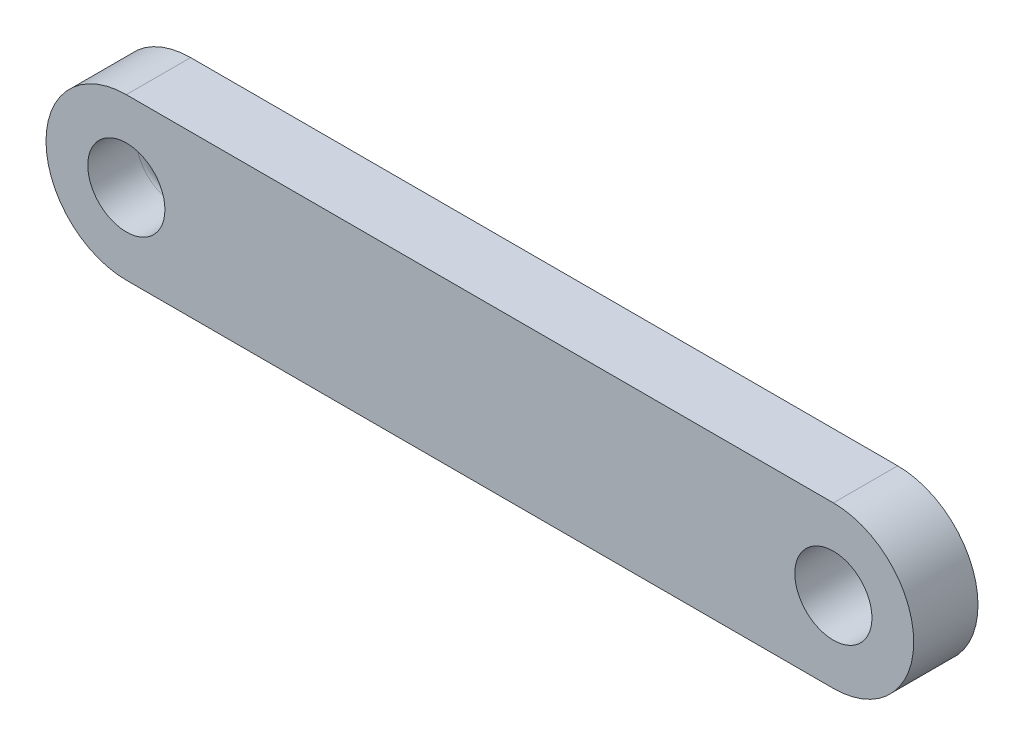
ISO-10303-21;
HEADER;
FILE_DESCRIPTION(('STEP AP214'),'2;1');
FILE_NAME('part.step','',(''),(''),'','','');
FILE_SCHEMA(('AUTOMOTIVE_DESIGN { 1 0 10303 214 1 1 1 1 }'));
ENDSEC;
DATA;
#1=APPLICATION_CONTEXT('core data for automotive mechanical design processes');
#2=APPLICATION_PROTOCOL_DEFINITION('international standard','automotive_design',2000,#1);
#3=PRODUCT_CONTEXT('',#1,'mechanical');
#4=PRODUCT('Part','Part','',(#3));
#5=PRODUCT_RELATED_PRODUCT_CATEGORY('part','',(#4));
#6=PRODUCT_DEFINITION_FORMATION('','',#4);
#7=PRODUCT_DEFINITION_CONTEXT('part definition',#1,'design');
#8=PRODUCT_DEFINITION('design','',#6,#7);
#9=PRODUCT_DEFINITION_SHAPE('','',#8);
#10=(LENGTH_UNIT() NAMED_UNIT(*) SI_UNIT(.MILLI.,.METRE.));
#11=(NAMED_UNIT(*) PLANE_ANGLE_UNIT() SI_UNIT($,.RADIAN.));
#12=(NAMED_UNIT(*) SI_UNIT($,.STERADIAN.) SOLID_ANGLE_UNIT());
#13=UNCERTAINTY_MEASURE_WITH_UNIT(LENGTH_MEASURE(1.E-05),#10,'distance_accuracy_value','');
#14=(GEOMETRIC_REPRESENTATION_CONTEXT(3) GLOBAL_UNCERTAINTY_ASSIGNED_CONTEXT((#13)) GLOBAL_UNIT_ASSIGNED_CONTEXT((#10,
#11,#12)) REPRESENTATION_CONTEXT('',''));
#15=CARTESIAN_POINT('',(0.,0.,0.));
#16=DIRECTION('',(0.,0.,1.));
#17=DIRECTION('',(1.,0.,0.));
#18=AXIS2_PLACEMENT_3D('',#15,#16,#17);
#19=CARTESIAN_POINT('',(0.,0.,20.));
#20=DIRECTION('',(0.,0.,1.));
#21=DIRECTION('',(1.,0.,0.));
#22=AXIS2_PLACEMENT_3D('',#19,#20,#21);
#23=PLANE('',#22);
#24=CARTESIAN_POINT('',(220.,0.,20.));
#25=DIRECTION('',(0.,0.,1.));
#26=DIRECTION('',(1.,0.,0.));
#27=AXIS2_PLACEMENT_3D('',#24,#25,#26);
#28=CIRCLE('',#27,12.);
#29=CARTESIAN_POINT('',(232.,0.,20.));
#30=VERTEX_POINT('',#29);
#31=EDGE_CURVE('E104',#30,#30,#28,.T.);
#32=ORIENTED_EDGE('',*,*,#31,.F.);
#33=EDGE_LOOP('',(#32));
#34=FACE_BOUND('',#33,.T.);
#35=CARTESIAN_POINT('',(0.,0.,20.));
#36=DIRECTION('',(0.,0.,1.));
#37=DIRECTION('',(1.,0.,0.));
#38=AXIS2_PLACEMENT_3D('',#35,#36,#37);
#39=CIRCLE('',#38,25.);
#40=CARTESIAN_POINT('',(0.,25.,20.));
#41=VERTEX_POINT('',#40);
#42=CARTESIAN_POINT('',(0.,-25.,20.));
#43=VERTEX_POINT('',#42);
#44=EDGE_CURVE('E86',#41,#43,#39,.T.);
#45=ORIENTED_EDGE('',*,*,#44,.T.);
#46=DIRECTION('',(1.,0.,0.));
#47=VECTOR('',#46,1.);
#48=CARTESIAN_POINT('',(0.,-25.,20.));
#49=LINE('',#48,#47);
#50=CARTESIAN_POINT('',(220.,-25.,20.));
#51=VERTEX_POINT('',#50);
#52=EDGE_CURVE('E81',#43,#51,#49,.T.);
#53=ORIENTED_EDGE('',*,*,#52,.T.);
#54=CARTESIAN_POINT('',(220.,0.,20.));
#55=DIRECTION('',(0.,0.,1.));
#56=DIRECTION('',(1.,0.,0.));
#57=AXIS2_PLACEMENT_3D('',#54,#55,#56);
#58=CIRCLE('',#57,25.);
#59=CARTESIAN_POINT('',(220.,25.,20.));
#60=VERTEX_POINT('',#59);
#61=EDGE_CURVE('E84',#51,#60,#58,.T.);
#62=ORIENTED_EDGE('',*,*,#61,.T.);
#63=DIRECTION('',(-1.,0.,0.));
#64=VECTOR('',#63,1.);
#65=CARTESIAN_POINT('',(0.,25.,20.));
#66=LINE('',#65,#64);
#67=EDGE_CURVE('E50',#60,#41,#66,.T.);
#68=ORIENTED_EDGE('',*,*,#67,.T.);
#69=EDGE_LOOP('',(#45,#53,#62,#68));
#70=FACE_BOUND('',#69,.T.);
#71=CARTESIAN_POINT('',(0.,0.,20.));
#72=DIRECTION('',(0.,0.,1.));
#73=DIRECTION('',(1.,0.,0.));
#74=AXIS2_PLACEMENT_3D('',#71,#72,#73);
#75=CIRCLE('',#74,12.);
#76=CARTESIAN_POINT('',(12.,0.,20.));
#77=VERTEX_POINT('',#76);
#78=EDGE_CURVE('E155',#77,#77,#75,.T.);
#79=ORIENTED_EDGE('',*,*,#78,.F.);
#80=EDGE_LOOP('',(#79));
#81=FACE_BOUND('',#80,.T.);
#82=ADVANCED_FACE('F33',(#34,#70,#81),#23,.T.);
#83=CARTESIAN_POINT('',(0.,0.,0.));
#84=DIRECTION('',(0.,0.,1.));
#85=DIRECTION('',(1.,0.,0.));
#86=AXIS2_PLACEMENT_3D('',#83,#84,#85);
#87=PLANE('',#86);
#88=CARTESIAN_POINT('',(0.,0.,0.));
#89=DIRECTION('',(0.,0.,1.));
#90=DIRECTION('',(1.,0.,0.));
#91=AXIS2_PLACEMENT_3D('',#88,#89,#90);
#92=CIRCLE('',#91,17.);
#93=CARTESIAN_POINT('',(17.,0.,0.));
#94=VERTEX_POINT('',#93);
#95=EDGE_CURVE('E42',#94,#94,#92,.T.);
#96=ORIENTED_EDGE('',*,*,#95,.T.);
#97=EDGE_LOOP('',(#96));
#98=FACE_BOUND('',#97,.T.);
#99=CARTESIAN_POINT('',(0.,0.,0.));
#100=DIRECTION('',(0.,0.,1.));
#101=DIRECTION('',(1.,0.,0.));
#102=AXIS2_PLACEMENT_3D('',#99,#100,#101);
#103=CIRCLE('',#102,25.);
#104=CARTESIAN_POINT('',(0.,25.,0.));
#105=VERTEX_POINT('',#104);
#106=CARTESIAN_POINT('',(0.,-25.,0.));
#107=VERTEX_POINT('',#106);
#108=EDGE_CURVE('E101',#105,#107,#103,.T.);
#109=ORIENTED_EDGE('',*,*,#108,.F.);
#110=DIRECTION('',(-1.,0.,0.));
#111=VECTOR('',#110,1.);
#112=CARTESIAN_POINT('',(0.,25.,0.));
#113=LINE('',#112,#111);
#114=CARTESIAN_POINT('',(220.,25.,0.));
#115=VERTEX_POINT('',#114);
#116=EDGE_CURVE('E73',#115,#105,#113,.T.);
#117=ORIENTED_EDGE('',*,*,#116,.F.);
#118=CARTESIAN_POINT('',(220.,0.,0.));
#119=DIRECTION('',(0.,0.,1.));
#120=DIRECTION('',(1.,0.,0.));
#121=AXIS2_PLACEMENT_3D('',#118,#119,#120);
#122=CIRCLE('',#121,25.);
#123=CARTESIAN_POINT('',(220.,-25.,0.));
#124=VERTEX_POINT('',#123);
#125=EDGE_CURVE('E67',#124,#115,#122,.T.);
#126=ORIENTED_EDGE('',*,*,#125,.F.);
#127=DIRECTION('',(1.,0.,0.));
#128=VECTOR('',#127,1.);
#129=CARTESIAN_POINT('',(0.,-25.,0.));
#130=LINE('',#129,#128);
#131=EDGE_CURVE('E91',#107,#124,#130,.T.);
#132=ORIENTED_EDGE('',*,*,#131,.F.);
#133=EDGE_LOOP('',(#109,#117,#126,#132));
#134=FACE_BOUND('',#133,.T.);
#135=CARTESIAN_POINT('',(220.,0.,0.));
#136=DIRECTION('',(0.,0.,1.));
#137=DIRECTION('',(1.,0.,0.));
#138=AXIS2_PLACEMENT_3D('',#135,#136,#137);
#139=CIRCLE('',#138,12.);
#140=CARTESIAN_POINT('',(232.,0.,0.));
#141=VERTEX_POINT('',#140);
#142=EDGE_CURVE('E153',#141,#141,#139,.T.);
#143=ORIENTED_EDGE('',*,*,#142,.T.);
#144=EDGE_LOOP('',(#143));
#145=FACE_BOUND('',#144,.T.);
#146=ADVANCED_FACE('F113',(#98,#134,#145),#87,.F.);
#147=CARTESIAN_POINT('',(0.,0.,20.));
#148=DIRECTION('',(0.,0.,-1.));
#149=DIRECTION('',(-1.,0.,0.));
#150=AXIS2_PLACEMENT_3D('',#147,#148,#149);
#151=CYLINDRICAL_SURFACE('',#150,25.);
#152=ORIENTED_EDGE('',*,*,#108,.T.);
#153=DIRECTION('',(0.,0.,-1.));
#154=VECTOR('',#153,1.);
#155=CARTESIAN_POINT('',(0.,-25.,20.));
#156=LINE('',#155,#154);
#157=EDGE_CURVE('E92',#43,#107,#156,.T.);
#158=ORIENTED_EDGE('',*,*,#157,.F.);
#159=ORIENTED_EDGE('',*,*,#44,.F.);
#160=DIRECTION('',(0.,0.,-1.));
#161=VECTOR('',#160,1.);
#162=CARTESIAN_POINT('',(0.,25.,20.));
#163=LINE('',#162,#161);
#164=EDGE_CURVE('E97',#41,#105,#163,.T.);
#165=ORIENTED_EDGE('',*,*,#164,.T.);
#166=EDGE_LOOP('',(#152,#158,#159,#165));
#167=FACE_BOUND('',#166,.T.);
#168=ADVANCED_FACE('F134',(#167),#151,.T.);
#169=CARTESIAN_POINT('',(0.,-25.,20.));
#170=DIRECTION('',(0.,1.,0.));
#171=DIRECTION('',(0.,0.,1.));
#172=AXIS2_PLACEMENT_3D('',#169,#170,#171);
#173=PLANE('',#172);
#174=ORIENTED_EDGE('',*,*,#131,.T.);
#175=DIRECTION('',(0.,0.,-1.));
#176=VECTOR('',#175,1.);
#177=CARTESIAN_POINT('',(220.,-25.,20.));
#178=LINE('',#177,#176);
#179=EDGE_CURVE('E89',#51,#124,#178,.T.);
#180=ORIENTED_EDGE('',*,*,#179,.F.);
#181=ORIENTED_EDGE('',*,*,#52,.F.);
#182=ORIENTED_EDGE('',*,*,#157,.T.);
#183=EDGE_LOOP('',(#174,#180,#181,#182));
#184=FACE_BOUND('',#183,.T.);
#185=ADVANCED_FACE('F90',(#184),#173,.F.);
#186=CARTESIAN_POINT('',(220.,0.,20.));
#187=DIRECTION('',(0.,0.,-1.));
#188=DIRECTION('',(-1.,0.,0.));
#189=AXIS2_PLACEMENT_3D('',#186,#187,#188);
#190=CYLINDRICAL_SURFACE('',#189,25.);
#191=ORIENTED_EDGE('',*,*,#125,.T.);
#192=DIRECTION('',(0.,0.,-1.));
#193=VECTOR('',#192,1.);
#194=CARTESIAN_POINT('',(220.,25.,20.));
#195=LINE('',#194,#193);
#196=EDGE_CURVE('E93',#60,#115,#195,.T.);
#197=ORIENTED_EDGE('',*,*,#196,.F.);
#198=ORIENTED_EDGE('',*,*,#61,.F.);
#199=ORIENTED_EDGE('',*,*,#179,.T.);
#200=EDGE_LOOP('',(#191,#197,#198,#199));
#201=FACE_BOUND('',#200,.T.);
#202=ADVANCED_FACE('F95',(#201),#190,.T.);
#203=CARTESIAN_POINT('',(0.,25.,20.));
#204=DIRECTION('',(0.,-1.,0.));
#205=DIRECTION('',(0.,0.,-1.));
#206=AXIS2_PLACEMENT_3D('',#203,#204,#205);
#207=PLANE('',#206);
#208=ORIENTED_EDGE('',*,*,#116,.T.);
#209=ORIENTED_EDGE('',*,*,#164,.F.);
#210=ORIENTED_EDGE('',*,*,#67,.F.);
#211=ORIENTED_EDGE('',*,*,#196,.T.);
#212=EDGE_LOOP('',(#208,#209,#210,#211));
#213=FACE_BOUND('',#212,.T.);
#214=ADVANCED_FACE('F139',(#213),#207,.F.);
#215=CARTESIAN_POINT('',(220.,0.,20.));
#216=DIRECTION('',(0.,0.,-1.));
#217=DIRECTION('',(-1.,0.,0.));
#218=AXIS2_PLACEMENT_3D('',#215,#216,#217);
#219=CYLINDRICAL_SURFACE('',#218,12.);
#220=ORIENTED_EDGE('',*,*,#31,.T.);
#221=EDGE_LOOP('',(#220));
#222=FACE_BOUND('',#221,.T.);
#223=ORIENTED_EDGE('',*,*,#142,.F.);
#224=EDGE_LOOP('',(#223));
#225=FACE_BOUND('',#224,.T.);
#226=ADVANCED_FACE('F123',(#222,#225),#219,.F.);
#227=CARTESIAN_POINT('',(0.,0.,20.));
#228=DIRECTION('',(0.,0.,-1.));
#229=DIRECTION('',(-1.,0.,0.));
#230=AXIS2_PLACEMENT_3D('',#227,#228,#229);
#231=CYLINDRICAL_SURFACE('',#230,12.);
#232=CARTESIAN_POINT('',(0.,0.,5.));
#233=DIRECTION('',(0.,0.,1.));
#234=DIRECTION('',(1.,0.,0.));
#235=AXIS2_PLACEMENT_3D('',#232,#233,#234);
#236=CIRCLE('',#235,12.);
#237=CARTESIAN_POINT('',(12.,0.,5.));
#238=VERTEX_POINT('',#237);
#239=EDGE_CURVE('E11',#238,#238,#236,.F.);
#240=ORIENTED_EDGE('',*,*,#239,.T.);
#241=EDGE_LOOP('',(#240));
#242=FACE_BOUND('',#241,.T.);
#243=ORIENTED_EDGE('',*,*,#78,.T.);
#244=EDGE_LOOP('',(#243));
#245=FACE_BOUND('',#244,.T.);
#246=ADVANCED_FACE('F117',(#242,#245),#231,.F.);
#247=CARTESIAN_POINT('',(0.,0.,5.));
#248=DIRECTION('',(0.,0.,1.));
#249=DIRECTION('',(1.,0.,0.));
#250=AXIS2_PLACEMENT_3D('',#247,#248,#249);
#251=TOROIDAL_SURFACE('',#250,17.,5.);
#252=ORIENTED_EDGE('',*,*,#239,.F.);
#253=EDGE_LOOP('',(#252));
#254=FACE_BOUND('',#253,.T.);
#255=ORIENTED_EDGE('',*,*,#95,.F.);
#256=EDGE_LOOP('',(#255));
#257=FACE_BOUND('',#256,.T.);
#258=ADVANCED_FACE('F35',(#254,#257),#251,.T.);
#259=CLOSED_SHELL('',(#82,#146,#168,#185,#202,#214,#226,#246,#258));
#260=MANIFOLD_SOLID_BREP('B2',#259);
#261=ADVANCED_BREP_SHAPE_REPRESENTATION('',(#18,#260),#14);
#262=SHAPE_DEFINITION_REPRESENTATION(#9,#261);
ENDSEC;
END-ISO-10303-21;
